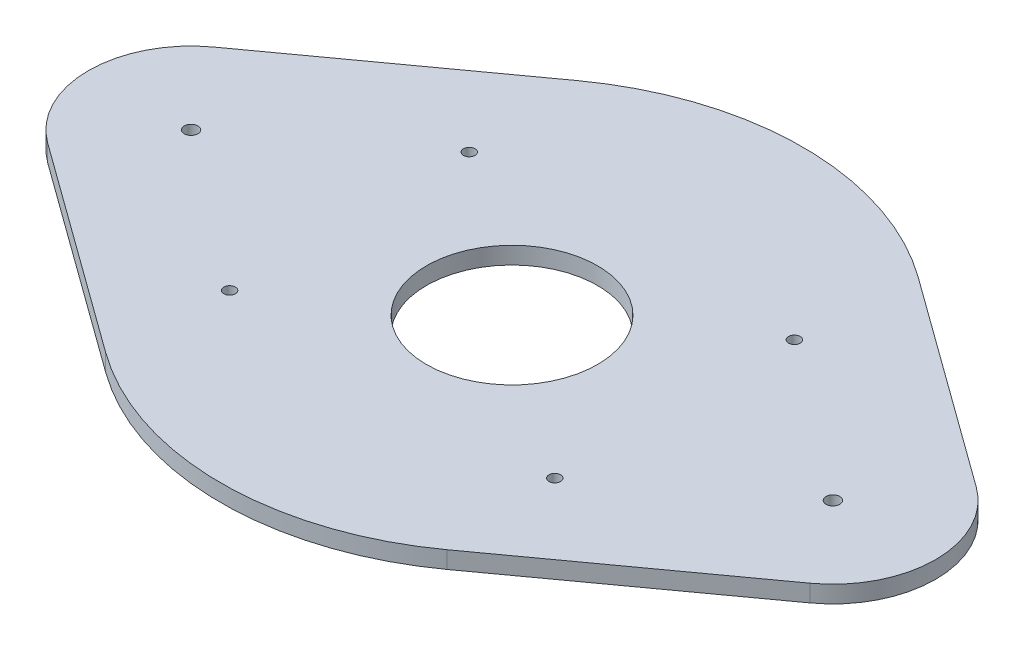
ISO-10303-21;
HEADER;
FILE_DESCRIPTION(('STEP AP214'),'2;1');
FILE_NAME('part.step','',(''),(''),'','','');
FILE_SCHEMA(('AUTOMOTIVE_DESIGN { 1 0 10303 214 1 1 1 1 }'));
ENDSEC;
DATA;
#1=APPLICATION_CONTEXT('core data for automotive mechanical design processes');
#2=APPLICATION_PROTOCOL_DEFINITION('international standard','automotive_design',2000,#1);
#3=PRODUCT_CONTEXT('',#1,'mechanical');
#4=PRODUCT('Part','Part','',(#3));
#5=PRODUCT_RELATED_PRODUCT_CATEGORY('part','',(#4));
#6=PRODUCT_DEFINITION_FORMATION('','',#4);
#7=PRODUCT_DEFINITION_CONTEXT('part definition',#1,'design');
#8=PRODUCT_DEFINITION('design','',#6,#7);
#9=PRODUCT_DEFINITION_SHAPE('','',#8);
#10=(LENGTH_UNIT() NAMED_UNIT(*) SI_UNIT(.MILLI.,.METRE.));
#11=(NAMED_UNIT(*) PLANE_ANGLE_UNIT() SI_UNIT($,.RADIAN.));
#12=(NAMED_UNIT(*) SI_UNIT($,.STERADIAN.) SOLID_ANGLE_UNIT());
#13=UNCERTAINTY_MEASURE_WITH_UNIT(LENGTH_MEASURE(1.E-05),#10,'distance_accuracy_value','');
#14=(GEOMETRIC_REPRESENTATION_CONTEXT(3) GLOBAL_UNCERTAINTY_ASSIGNED_CONTEXT((#13)) GLOBAL_UNIT_ASSIGNED_CONTEXT((#10,
#11,#12)) REPRESENTATION_CONTEXT('',''));
#15=CARTESIAN_POINT('',(0.,0.,0.));
#16=DIRECTION('',(0.,0.,1.));
#17=DIRECTION('',(1.,0.,0.));
#18=AXIS2_PLACEMENT_3D('',#15,#16,#17);
#19=CARTESIAN_POINT('',(0.,10.,0.));
#20=DIRECTION('',(0.,-1.,0.));
#21=DIRECTION('',(0.,0.,-1.));
#22=AXIS2_PLACEMENT_3D('',#19,#20,#21);
#23=CYLINDRICAL_SURFACE('',#22,170.);
#24=CARTESIAN_POINT('',(0.,0.,0.));
#25=DIRECTION('',(0.,1.,0.));
#26=DIRECTION('',(0.,0.,1.));
#27=AXIS2_PLACEMENT_3D('',#24,#25,#26);
#28=CIRCLE('',#27,170.);
#29=CARTESIAN_POINT('',(99.7333333333334,0.,137.670847394146));
#30=VERTEX_POINT('',#29);
#31=CARTESIAN_POINT('',(-99.7333333333333,0.,137.670847394146));
#32=VERTEX_POINT('',#31);
#33=EDGE_CURVE('E174',#30,#32,#28,.F.);
#34=ORIENTED_EDGE('',*,*,#33,.F.);
#35=DIRECTION('',(0.,-1.,0.));
#36=VECTOR('',#35,1.);
#37=CARTESIAN_POINT('',(99.7333333333334,10.,137.670847394146));
#38=LINE('',#37,#36);
#39=CARTESIAN_POINT('',(99.7333333333334,10.,137.670847394146));
#40=VERTEX_POINT('',#39);
#41=EDGE_CURVE('E11',#40,#30,#38,.T.);
#42=ORIENTED_EDGE('',*,*,#41,.F.);
#43=CARTESIAN_POINT('',(0.,10.,0.));
#44=DIRECTION('',(0.,1.,0.));
#45=DIRECTION('',(0.,0.,1.));
#46=AXIS2_PLACEMENT_3D('',#43,#44,#45);
#47=CIRCLE('',#46,170.);
#48=CARTESIAN_POINT('',(-99.7333333333333,10.,137.670847394146));
#49=VERTEX_POINT('',#48);
#50=EDGE_CURVE('E232',#40,#49,#47,.F.);
#51=ORIENTED_EDGE('',*,*,#50,.T.);
#52=DIRECTION('',(0.,-1.,0.));
#53=VECTOR('',#52,1.);
#54=CARTESIAN_POINT('',(-99.7333333333333,10.,137.670847394146));
#55=LINE('',#54,#53);
#56=EDGE_CURVE('E99',#49,#32,#55,.T.);
#57=ORIENTED_EDGE('',*,*,#56,.T.);
#58=EDGE_LOOP('',(#34,#42,#51,#57));
#59=FACE_BOUND('',#58,.T.);
#60=ADVANCED_FACE('F47',(#59),#23,.T.);
#61=CARTESIAN_POINT('',(99.7333333333334,10.,137.670847394146));
#62=DIRECTION('',(0.586666666666667,0.,0.809828514083211));
#63=DIRECTION('',(0.809828514083211,0.,-0.586666666666667));
#64=AXIS2_PLACEMENT_3D('',#61,#62,#63);
#65=PLANE('',#64);
#66=DIRECTION('',(-0.809828514083211,0.,0.586666666666667));
#67=VECTOR('',#66,1.);
#68=CARTESIAN_POINT('',(99.7333333333334,0.,137.670847394146));
#69=LINE('',#68,#67);
#70=CARTESIAN_POINT('',(222.7,0.,48.5897108449927));
#71=VERTEX_POINT('',#70);
#72=EDGE_CURVE('E178',#71,#30,#69,.T.);
#73=ORIENTED_EDGE('',*,*,#72,.F.);
#74=DIRECTION('',(0.,-1.,0.));
#75=VECTOR('',#74,1.);
#76=CARTESIAN_POINT('',(222.7,10.,48.5897108449927));
#77=LINE('',#76,#75);
#78=CARTESIAN_POINT('',(222.7,10.,48.5897108449927));
#79=VERTEX_POINT('',#78);
#80=EDGE_CURVE('E57',#79,#71,#77,.T.);
#81=ORIENTED_EDGE('',*,*,#80,.F.);
#82=DIRECTION('',(-0.809828514083211,0.,0.586666666666667));
#83=VECTOR('',#82,1.);
#84=CARTESIAN_POINT('',(99.7333333333334,10.,137.670847394146));
#85=LINE('',#84,#83);
#86=EDGE_CURVE('E230',#79,#40,#85,.T.);
#87=ORIENTED_EDGE('',*,*,#86,.T.);
#88=ORIENTED_EDGE('',*,*,#41,.T.);
#89=EDGE_LOOP('',(#73,#81,#87,#88));
#90=FACE_BOUND('',#89,.T.);
#91=ADVANCED_FACE('F229',(#90),#65,.T.);
#92=CARTESIAN_POINT('',(187.5,10.,0.));
#93=DIRECTION('',(0.,-1.,0.));
#94=DIRECTION('',(0.,0.,-1.));
#95=AXIS2_PLACEMENT_3D('',#92,#93,#94);
#96=CYLINDRICAL_SURFACE('',#95,60.);
#97=CARTESIAN_POINT('',(187.5,0.,0.));
#98=DIRECTION('',(0.,1.,0.));
#99=DIRECTION('',(0.,0.,1.));
#100=AXIS2_PLACEMENT_3D('',#97,#98,#99);
#101=CIRCLE('',#100,60.);
#102=CARTESIAN_POINT('',(222.7,0.,-48.5897108449928));
#103=VERTEX_POINT('',#102);
#104=EDGE_CURVE('E182',#71,#103,#101,.T.);
#105=ORIENTED_EDGE('',*,*,#104,.T.);
#106=DIRECTION('',(0.,-1.,0.));
#107=VECTOR('',#106,1.);
#108=CARTESIAN_POINT('',(222.7,10.,-48.5897108449928));
#109=LINE('',#108,#107);
#110=CARTESIAN_POINT('',(222.7,10.,-48.5897108449928));
#111=VERTEX_POINT('',#110);
#112=EDGE_CURVE('E212',#111,#103,#109,.T.);
#113=ORIENTED_EDGE('',*,*,#112,.F.);
#114=CARTESIAN_POINT('',(187.5,10.,0.));
#115=DIRECTION('',(0.,1.,0.));
#116=DIRECTION('',(0.,0.,1.));
#117=AXIS2_PLACEMENT_3D('',#114,#115,#116);
#118=CIRCLE('',#117,60.);
#119=EDGE_CURVE('E220',#79,#111,#118,.T.);
#120=ORIENTED_EDGE('',*,*,#119,.F.);
#121=ORIENTED_EDGE('',*,*,#80,.T.);
#122=EDGE_LOOP('',(#105,#113,#120,#121));
#123=FACE_BOUND('',#122,.T.);
#124=ADVANCED_FACE('F218',(#123),#96,.T.);
#125=CARTESIAN_POINT('',(99.7333333333333,10.,-137.670847394146));
#126=DIRECTION('',(0.586666666666666,0.,-0.809828514083212));
#127=DIRECTION('',(-0.809828514083212,0.,-0.586666666666666));
#128=AXIS2_PLACEMENT_3D('',#125,#126,#127);
#129=PLANE('',#128);
#130=DIRECTION('',(0.809828514083212,0.,0.586666666666666));
#131=VECTOR('',#130,1.);
#132=CARTESIAN_POINT('',(99.7333333333333,0.,-137.670847394146));
#133=LINE('',#132,#131);
#134=CARTESIAN_POINT('',(99.7333333333333,0.,-137.670847394146));
#135=VERTEX_POINT('',#134);
#136=EDGE_CURVE('E186',#135,#103,#133,.T.);
#137=ORIENTED_EDGE('',*,*,#136,.F.);
#138=DIRECTION('',(0.,-1.,0.));
#139=VECTOR('',#138,1.);
#140=CARTESIAN_POINT('',(99.7333333333333,10.,-137.670847394146));
#141=LINE('',#140,#139);
#142=CARTESIAN_POINT('',(99.7333333333333,10.,-137.670847394146));
#143=VERTEX_POINT('',#142);
#144=EDGE_CURVE('E209',#143,#135,#141,.T.);
#145=ORIENTED_EDGE('',*,*,#144,.F.);
#146=DIRECTION('',(0.809828514083212,0.,0.586666666666666));
#147=VECTOR('',#146,1.);
#148=CARTESIAN_POINT('',(99.7333333333333,10.,-137.670847394146));
#149=LINE('',#148,#147);
#150=EDGE_CURVE('E246',#143,#111,#149,.T.);
#151=ORIENTED_EDGE('',*,*,#150,.T.);
#152=ORIENTED_EDGE('',*,*,#112,.T.);
#153=EDGE_LOOP('',(#137,#145,#151,#152));
#154=FACE_BOUND('',#153,.T.);
#155=ADVANCED_FACE('F251',(#154),#129,.T.);
#156=CARTESIAN_POINT('',(0.,10.,0.));
#157=DIRECTION('',(0.,-1.,0.));
#158=DIRECTION('',(0.,0.,-1.));
#159=AXIS2_PLACEMENT_3D('',#156,#157,#158);
#160=CYLINDRICAL_SURFACE('',#159,170.);
#161=CARTESIAN_POINT('',(0.,0.,0.));
#162=DIRECTION('',(0.,1.,0.));
#163=DIRECTION('',(0.,0.,1.));
#164=AXIS2_PLACEMENT_3D('',#161,#162,#163);
#165=CIRCLE('',#164,170.);
#166=CARTESIAN_POINT('',(-99.7333333333333,0.,-137.670847394146));
#167=VERTEX_POINT('',#166);
#168=EDGE_CURVE('E190',#135,#167,#165,.T.);
#169=ORIENTED_EDGE('',*,*,#168,.T.);
#170=DIRECTION('',(0.,-1.,0.));
#171=VECTOR('',#170,1.);
#172=CARTESIAN_POINT('',(-99.7333333333333,10.,-137.670847394146));
#173=LINE('',#172,#171);
#174=CARTESIAN_POINT('',(-99.7333333333333,10.,-137.670847394146));
#175=VERTEX_POINT('',#174);
#176=EDGE_CURVE('E137',#175,#167,#173,.T.);
#177=ORIENTED_EDGE('',*,*,#176,.F.);
#178=CARTESIAN_POINT('',(0.,10.,0.));
#179=DIRECTION('',(0.,1.,0.));
#180=DIRECTION('',(0.,0.,1.));
#181=AXIS2_PLACEMENT_3D('',#178,#179,#180);
#182=CIRCLE('',#181,170.);
#183=EDGE_CURVE('E123',#143,#175,#182,.T.);
#184=ORIENTED_EDGE('',*,*,#183,.F.);
#185=ORIENTED_EDGE('',*,*,#144,.T.);
#186=EDGE_LOOP('',(#169,#177,#184,#185));
#187=FACE_BOUND('',#186,.T.);
#188=ADVANCED_FACE('F253',(#187),#160,.T.);
#189=CARTESIAN_POINT('',(-99.7333333333333,10.,-137.670847394146));
#190=DIRECTION('',(0.586666666666667,0.,0.809828514083212));
#191=DIRECTION('',(0.809828514083211,0.,-0.586666666666667));
#192=AXIS2_PLACEMENT_3D('',#189,#190,#191);
#193=PLANE('',#192);
#194=DIRECTION('',(-0.809828514083211,0.,0.586666666666667));
#195=VECTOR('',#194,1.);
#196=CARTESIAN_POINT('',(-99.7333333333333,0.,-137.670847394146));
#197=LINE('',#196,#195);
#198=CARTESIAN_POINT('',(-222.7,0.,-48.5897108449927));
#199=VERTEX_POINT('',#198);
#200=EDGE_CURVE('E132',#167,#199,#197,.T.);
#201=ORIENTED_EDGE('',*,*,#200,.T.);
#202=DIRECTION('',(0.,-1.,0.));
#203=VECTOR('',#202,1.);
#204=CARTESIAN_POINT('',(-222.7,10.,-48.5897108449927));
#205=LINE('',#204,#203);
#206=CARTESIAN_POINT('',(-222.7,10.,-48.5897108449927));
#207=VERTEX_POINT('',#206);
#208=EDGE_CURVE('E130',#207,#199,#205,.T.);
#209=ORIENTED_EDGE('',*,*,#208,.F.);
#210=DIRECTION('',(-0.809828514083211,0.,0.586666666666667));
#211=VECTOR('',#210,1.);
#212=CARTESIAN_POINT('',(-99.7333333333333,10.,-137.670847394146));
#213=LINE('',#212,#211);
#214=EDGE_CURVE('E116',#175,#207,#213,.T.);
#215=ORIENTED_EDGE('',*,*,#214,.F.);
#216=ORIENTED_EDGE('',*,*,#176,.T.);
#217=EDGE_LOOP('',(#201,#209,#215,#216));
#218=FACE_BOUND('',#217,.T.);
#219=ADVANCED_FACE('F131',(#218),#193,.F.);
#220=CARTESIAN_POINT('',(-187.5,10.,0.));
#221=DIRECTION('',(0.,-1.,0.));
#222=DIRECTION('',(0.,0.,-1.));
#223=AXIS2_PLACEMENT_3D('',#220,#221,#222);
#224=CYLINDRICAL_SURFACE('',#223,60.);
#225=CARTESIAN_POINT('',(-187.5,0.,0.));
#226=DIRECTION('',(0.,1.,0.));
#227=DIRECTION('',(0.,0.,1.));
#228=AXIS2_PLACEMENT_3D('',#225,#226,#227);
#229=CIRCLE('',#228,60.);
#230=CARTESIAN_POINT('',(-222.7,0.,48.5897108449927));
#231=VERTEX_POINT('',#230);
#232=EDGE_CURVE('E196',#231,#199,#229,.F.);
#233=ORIENTED_EDGE('',*,*,#232,.F.);
#234=DIRECTION('',(0.,-1.,0.));
#235=VECTOR('',#234,1.);
#236=CARTESIAN_POINT('',(-222.7,10.,48.5897108449927));
#237=LINE('',#236,#235);
#238=CARTESIAN_POINT('',(-222.7,10.,48.5897108449927));
#239=VERTEX_POINT('',#238);
#240=EDGE_CURVE('E92',#239,#231,#237,.T.);
#241=ORIENTED_EDGE('',*,*,#240,.F.);
#242=CARTESIAN_POINT('',(-187.5,10.,0.));
#243=DIRECTION('',(0.,1.,0.));
#244=DIRECTION('',(0.,0.,1.));
#245=AXIS2_PLACEMENT_3D('',#242,#243,#244);
#246=CIRCLE('',#245,60.);
#247=EDGE_CURVE('E120',#239,#207,#246,.F.);
#248=ORIENTED_EDGE('',*,*,#247,.T.);
#249=ORIENTED_EDGE('',*,*,#208,.T.);
#250=EDGE_LOOP('',(#233,#241,#248,#249));
#251=FACE_BOUND('',#250,.T.);
#252=ADVANCED_FACE('F139',(#251),#224,.T.);
#253=CARTESIAN_POINT('',(0.,10.,0.));
#254=DIRECTION('',(0.,-1.,0.));
#255=DIRECTION('',(0.,0.,-1.));
#256=AXIS2_PLACEMENT_3D('',#253,#254,#255);
#257=CYLINDRICAL_SURFACE('',#256,50.);
#258=CARTESIAN_POINT('',(0.,10.,0.));
#259=DIRECTION('',(0.,1.,0.));
#260=DIRECTION('',(0.,0.,1.));
#261=AXIS2_PLACEMENT_3D('',#258,#259,#260);
#262=CIRCLE('',#261,50.);
#263=CARTESIAN_POINT('',(0.,10.,50.));
#264=VERTEX_POINT('',#263);
#265=EDGE_CURVE('E234',#264,#264,#262,.T.);
#266=ORIENTED_EDGE('',*,*,#265,.T.);
#267=EDGE_LOOP('',(#266));
#268=FACE_BOUND('',#267,.T.);
#269=CARTESIAN_POINT('',(0.,0.,0.));
#270=DIRECTION('',(0.,1.,0.));
#271=DIRECTION('',(0.,0.,1.));
#272=AXIS2_PLACEMENT_3D('',#269,#270,#271);
#273=CIRCLE('',#272,50.);
#274=CARTESIAN_POINT('',(0.,0.,50.));
#275=VERTEX_POINT('',#274);
#276=EDGE_CURVE('E170',#275,#275,#273,.T.);
#277=ORIENTED_EDGE('',*,*,#276,.F.);
#278=EDGE_LOOP('',(#277));
#279=FACE_BOUND('',#278,.T.);
#280=ADVANCED_FACE('F270',(#268,#279),#257,.F.);
#281=CARTESIAN_POINT('',(-95.,10.,-70.));
#282=DIRECTION('',(0.,-1.,0.));
#283=DIRECTION('',(0.,0.,-1.));
#284=AXIS2_PLACEMENT_3D('',#281,#282,#283);
#285=CYLINDRICAL_SURFACE('',#284,3.4);
#286=CARTESIAN_POINT('',(-95.,10.,-70.));
#287=DIRECTION('',(0.,1.,0.));
#288=DIRECTION('',(0.,0.,1.));
#289=AXIS2_PLACEMENT_3D('',#286,#287,#288);
#290=CIRCLE('',#289,3.4);
#291=CARTESIAN_POINT('',(-95.,10.,-66.6));
#292=VERTEX_POINT('',#291);
#293=EDGE_CURVE('E240',#292,#292,#290,.T.);
#294=ORIENTED_EDGE('',*,*,#293,.T.);
#295=EDGE_LOOP('',(#294));
#296=FACE_BOUND('',#295,.T.);
#297=CARTESIAN_POINT('',(-95.,0.,-70.));
#298=DIRECTION('',(0.,1.,0.));
#299=DIRECTION('',(0.,0.,1.));
#300=AXIS2_PLACEMENT_3D('',#297,#298,#299);
#301=CIRCLE('',#300,3.4);
#302=CARTESIAN_POINT('',(-95.,0.,-66.6));
#303=VERTEX_POINT('',#302);
#304=EDGE_CURVE('E166',#303,#303,#301,.T.);
#305=ORIENTED_EDGE('',*,*,#304,.F.);
#306=EDGE_LOOP('',(#305));
#307=FACE_BOUND('',#306,.T.);
#308=ADVANCED_FACE('F273',(#296,#307),#285,.F.);
#309=CARTESIAN_POINT('',(95.,10.,-70.));
#310=DIRECTION('',(0.,-1.,0.));
#311=DIRECTION('',(0.,0.,-1.));
#312=AXIS2_PLACEMENT_3D('',#309,#310,#311);
#313=CYLINDRICAL_SURFACE('',#312,3.4);
#314=CARTESIAN_POINT('',(95.,10.,-70.));
#315=DIRECTION('',(0.,1.,0.));
#316=DIRECTION('',(0.,0.,1.));
#317=AXIS2_PLACEMENT_3D('',#314,#315,#316);
#318=CIRCLE('',#317,3.4);
#319=CARTESIAN_POINT('',(95.,10.,-66.6));
#320=VERTEX_POINT('',#319);
#321=EDGE_CURVE('E441',#320,#320,#318,.T.);
#322=ORIENTED_EDGE('',*,*,#321,.T.);
#323=EDGE_LOOP('',(#322));
#324=FACE_BOUND('',#323,.T.);
#325=CARTESIAN_POINT('',(95.,0.,-70.));
#326=DIRECTION('',(0.,1.,0.));
#327=DIRECTION('',(0.,0.,1.));
#328=AXIS2_PLACEMENT_3D('',#325,#326,#327);
#329=CIRCLE('',#328,3.4);
#330=CARTESIAN_POINT('',(95.,0.,-66.6));
#331=VERTEX_POINT('',#330);
#332=EDGE_CURVE('E162',#331,#331,#329,.T.);
#333=ORIENTED_EDGE('',*,*,#332,.F.);
#334=EDGE_LOOP('',(#333));
#335=FACE_BOUND('',#334,.T.);
#336=ADVANCED_FACE('F277',(#324,#335),#313,.F.);
#337=CARTESIAN_POINT('',(95.,10.,70.));
#338=DIRECTION('',(0.,-1.,0.));
#339=DIRECTION('',(0.,0.,-1.));
#340=AXIS2_PLACEMENT_3D('',#337,#338,#339);
#341=CYLINDRICAL_SURFACE('',#340,3.4);
#342=CARTESIAN_POINT('',(95.,10.,70.));
#343=DIRECTION('',(0.,1.,0.));
#344=DIRECTION('',(0.,0.,1.));
#345=AXIS2_PLACEMENT_3D('',#342,#343,#344);
#346=CIRCLE('',#345,3.4);
#347=CARTESIAN_POINT('',(95.,10.,73.4));
#348=VERTEX_POINT('',#347);
#349=EDGE_CURVE('E437',#348,#348,#346,.T.);
#350=ORIENTED_EDGE('',*,*,#349,.T.);
#351=EDGE_LOOP('',(#350));
#352=FACE_BOUND('',#351,.T.);
#353=CARTESIAN_POINT('',(95.,0.,70.));
#354=DIRECTION('',(0.,1.,0.));
#355=DIRECTION('',(0.,0.,1.));
#356=AXIS2_PLACEMENT_3D('',#353,#354,#355);
#357=CIRCLE('',#356,3.4);
#358=CARTESIAN_POINT('',(95.,0.,73.4));
#359=VERTEX_POINT('',#358);
#360=EDGE_CURVE('E158',#359,#359,#357,.T.);
#361=ORIENTED_EDGE('',*,*,#360,.F.);
#362=EDGE_LOOP('',(#361));
#363=FACE_BOUND('',#362,.T.);
#364=ADVANCED_FACE('F281',(#352,#363),#341,.F.);
#365=CARTESIAN_POINT('',(-95.,10.,70.));
#366=DIRECTION('',(0.,-1.,0.));
#367=DIRECTION('',(0.,0.,-1.));
#368=AXIS2_PLACEMENT_3D('',#365,#366,#367);
#369=CYLINDRICAL_SURFACE('',#368,3.40000000000001);
#370=CARTESIAN_POINT('',(-95.,10.,70.));
#371=DIRECTION('',(0.,1.,0.));
#372=DIRECTION('',(0.,0.,1.));
#373=AXIS2_PLACEMENT_3D('',#370,#371,#372);
#374=CIRCLE('',#373,3.40000000000001);
#375=CARTESIAN_POINT('',(-95.,10.,73.4));
#376=VERTEX_POINT('',#375);
#377=EDGE_CURVE('E433',#376,#376,#374,.T.);
#378=ORIENTED_EDGE('',*,*,#377,.T.);
#379=EDGE_LOOP('',(#378));
#380=FACE_BOUND('',#379,.T.);
#381=CARTESIAN_POINT('',(-95.,0.,70.));
#382=DIRECTION('',(0.,1.,0.));
#383=DIRECTION('',(0.,0.,1.));
#384=AXIS2_PLACEMENT_3D('',#381,#382,#383);
#385=CIRCLE('',#384,3.40000000000001);
#386=CARTESIAN_POINT('',(-95.,0.,73.4));
#387=VERTEX_POINT('',#386);
#388=EDGE_CURVE('E154',#387,#387,#385,.T.);
#389=ORIENTED_EDGE('',*,*,#388,.F.);
#390=EDGE_LOOP('',(#389));
#391=FACE_BOUND('',#390,.T.);
#392=ADVANCED_FACE('F285',(#380,#391),#369,.F.);
#393=CARTESIAN_POINT('',(187.5,10.,0.));
#394=DIRECTION('',(0.,-1.,0.));
#395=DIRECTION('',(0.,0.,-1.));
#396=AXIS2_PLACEMENT_3D('',#393,#394,#395);
#397=CYLINDRICAL_SURFACE('',#396,3.99999999999999);
#398=CARTESIAN_POINT('',(187.5,10.,0.));
#399=DIRECTION('',(0.,1.,0.));
#400=DIRECTION('',(0.,0.,1.));
#401=AXIS2_PLACEMENT_3D('',#398,#399,#400);
#402=CIRCLE('',#401,3.99999999999999);
#403=CARTESIAN_POINT('',(187.5,10.,3.99999999999992));
#404=VERTEX_POINT('',#403);
#405=EDGE_CURVE('E299',#404,#404,#402,.T.);
#406=ORIENTED_EDGE('',*,*,#405,.T.);
#407=EDGE_LOOP('',(#406));
#408=FACE_BOUND('',#407,.T.);
#409=CARTESIAN_POINT('',(187.5,0.,0.));
#410=DIRECTION('',(0.,1.,0.));
#411=DIRECTION('',(0.,0.,1.));
#412=AXIS2_PLACEMENT_3D('',#409,#410,#411);
#413=CIRCLE('',#412,3.99999999999999);
#414=CARTESIAN_POINT('',(187.5,0.,3.99999999999992));
#415=VERTEX_POINT('',#414);
#416=EDGE_CURVE('E150',#415,#415,#413,.T.);
#417=ORIENTED_EDGE('',*,*,#416,.F.);
#418=EDGE_LOOP('',(#417));
#419=FACE_BOUND('',#418,.T.);
#420=ADVANCED_FACE('F288',(#408,#419),#397,.F.);
#421=CARTESIAN_POINT('',(-187.5,10.,0.));
#422=DIRECTION('',(0.,-1.,0.));
#423=DIRECTION('',(0.,0.,-1.));
#424=AXIS2_PLACEMENT_3D('',#421,#422,#423);
#425=CYLINDRICAL_SURFACE('',#424,3.99999999999999);
#426=CARTESIAN_POINT('',(-187.5,10.,0.));
#427=DIRECTION('',(0.,1.,0.));
#428=DIRECTION('',(0.,0.,1.));
#429=AXIS2_PLACEMENT_3D('',#426,#427,#428);
#430=CIRCLE('',#429,3.99999999999999);
#431=CARTESIAN_POINT('',(-187.5,10.,3.99999999999999));
#432=VERTEX_POINT('',#431);
#433=EDGE_CURVE('E202',#432,#432,#430,.T.);
#434=ORIENTED_EDGE('',*,*,#433,.T.);
#435=EDGE_LOOP('',(#434));
#436=FACE_BOUND('',#435,.T.);
#437=CARTESIAN_POINT('',(-187.5,0.,0.));
#438=DIRECTION('',(0.,1.,0.));
#439=DIRECTION('',(0.,0.,1.));
#440=AXIS2_PLACEMENT_3D('',#437,#438,#439);
#441=CIRCLE('',#440,3.99999999999999);
#442=CARTESIAN_POINT('',(-187.5,0.,3.99999999999999));
#443=VERTEX_POINT('',#442);
#444=EDGE_CURVE('E146',#443,#443,#441,.T.);
#445=ORIENTED_EDGE('',*,*,#444,.F.);
#446=EDGE_LOOP('',(#445));
#447=FACE_BOUND('',#446,.T.);
#448=ADVANCED_FACE('F49',(#436,#447),#425,.F.);
#449=CARTESIAN_POINT('',(-99.7333333333333,10.,137.670847394146));
#450=DIRECTION('',(0.586666666666666,0.,-0.809828514083212));
#451=DIRECTION('',(-0.809828514083212,0.,-0.586666666666666));
#452=AXIS2_PLACEMENT_3D('',#449,#450,#451);
#453=PLANE('',#452);
#454=DIRECTION('',(0.809828514083212,0.,0.586666666666666));
#455=VECTOR('',#454,1.);
#456=CARTESIAN_POINT('',(-99.7333333333333,0.,137.670847394146));
#457=LINE('',#456,#455);
#458=EDGE_CURVE('E199',#231,#32,#457,.T.);
#459=ORIENTED_EDGE('',*,*,#458,.T.);
#460=ORIENTED_EDGE('',*,*,#56,.F.);
#461=DIRECTION('',(0.809828514083212,0.,0.586666666666666));
#462=VECTOR('',#461,1.);
#463=CARTESIAN_POINT('',(-99.7333333333333,10.,137.670847394146));
#464=LINE('',#463,#462);
#465=EDGE_CURVE('E65',#239,#49,#464,.T.);
#466=ORIENTED_EDGE('',*,*,#465,.F.);
#467=ORIENTED_EDGE('',*,*,#240,.T.);
#468=EDGE_LOOP('',(#459,#460,#466,#467));
#469=FACE_BOUND('',#468,.T.);
#470=ADVANCED_FACE('F231',(#469),#453,.F.);
#471=CARTESIAN_POINT('',(0.,10.,0.));
#472=DIRECTION('',(0.,1.,0.));
#473=DIRECTION('',(0.,0.,1.));
#474=AXIS2_PLACEMENT_3D('',#471,#472,#473);
#475=PLANE('',#474);
#476=ORIENTED_EDGE('',*,*,#433,.F.);
#477=EDGE_LOOP('',(#476));
#478=FACE_BOUND('',#477,.T.);
#479=ORIENTED_EDGE('',*,*,#405,.F.);
#480=EDGE_LOOP('',(#479));
#481=FACE_BOUND('',#480,.T.);
#482=ORIENTED_EDGE('',*,*,#377,.F.);
#483=EDGE_LOOP('',(#482));
#484=FACE_BOUND('',#483,.T.);
#485=ORIENTED_EDGE('',*,*,#349,.F.);
#486=EDGE_LOOP('',(#485));
#487=FACE_BOUND('',#486,.T.);
#488=ORIENTED_EDGE('',*,*,#321,.F.);
#489=EDGE_LOOP('',(#488));
#490=FACE_BOUND('',#489,.T.);
#491=ORIENTED_EDGE('',*,*,#293,.F.);
#492=EDGE_LOOP('',(#491));
#493=FACE_BOUND('',#492,.T.);
#494=ORIENTED_EDGE('',*,*,#265,.F.);
#495=EDGE_LOOP('',(#494));
#496=FACE_BOUND('',#495,.T.);
#497=ORIENTED_EDGE('',*,*,#50,.F.);
#498=ORIENTED_EDGE('',*,*,#86,.F.);
#499=ORIENTED_EDGE('',*,*,#119,.T.);
#500=ORIENTED_EDGE('',*,*,#150,.F.);
#501=ORIENTED_EDGE('',*,*,#183,.T.);
#502=ORIENTED_EDGE('',*,*,#214,.T.);
#503=ORIENTED_EDGE('',*,*,#247,.F.);
#504=ORIENTED_EDGE('',*,*,#465,.T.);
#505=EDGE_LOOP('',(#497,#498,#499,#500,#501,#502,#503,#504));
#506=FACE_BOUND('',#505,.T.);
#507=ADVANCED_FACE('F118',(#478,#481,#484,#487,#490,#493,#496,#506),#475,.T.);
#508=CARTESIAN_POINT('',(0.,0.,0.));
#509=DIRECTION('',(0.,1.,0.));
#510=DIRECTION('',(0.,0.,1.));
#511=AXIS2_PLACEMENT_3D('',#508,#509,#510);
#512=PLANE('',#511);
#513=ORIENTED_EDGE('',*,*,#444,.T.);
#514=EDGE_LOOP('',(#513));
#515=FACE_BOUND('',#514,.T.);
#516=ORIENTED_EDGE('',*,*,#416,.T.);
#517=EDGE_LOOP('',(#516));
#518=FACE_BOUND('',#517,.T.);
#519=ORIENTED_EDGE('',*,*,#388,.T.);
#520=EDGE_LOOP('',(#519));
#521=FACE_BOUND('',#520,.T.);
#522=ORIENTED_EDGE('',*,*,#360,.T.);
#523=EDGE_LOOP('',(#522));
#524=FACE_BOUND('',#523,.T.);
#525=ORIENTED_EDGE('',*,*,#332,.T.);
#526=EDGE_LOOP('',(#525));
#527=FACE_BOUND('',#526,.T.);
#528=ORIENTED_EDGE('',*,*,#304,.T.);
#529=EDGE_LOOP('',(#528));
#530=FACE_BOUND('',#529,.T.);
#531=ORIENTED_EDGE('',*,*,#276,.T.);
#532=EDGE_LOOP('',(#531));
#533=FACE_BOUND('',#532,.T.);
#534=ORIENTED_EDGE('',*,*,#33,.T.);
#535=ORIENTED_EDGE('',*,*,#458,.F.);
#536=ORIENTED_EDGE('',*,*,#232,.T.);
#537=ORIENTED_EDGE('',*,*,#200,.F.);
#538=ORIENTED_EDGE('',*,*,#168,.F.);
#539=ORIENTED_EDGE('',*,*,#136,.T.);
#540=ORIENTED_EDGE('',*,*,#104,.F.);
#541=ORIENTED_EDGE('',*,*,#72,.T.);
#542=EDGE_LOOP('',(#534,#535,#536,#537,#538,#539,#540,#541));
#543=FACE_BOUND('',#542,.T.);
#544=ADVANCED_FACE('F226',(#515,#518,#521,#524,#527,#530,#533,#543),#512,.F.);
#545=CLOSED_SHELL('',(#60,#91,#124,#155,#188,#219,#252,#280,#308,#336,#364,#392,#420,#448,#470,
#507,#544));
#546=MANIFOLD_SOLID_BREP('B2',#545);
#547=ADVANCED_BREP_SHAPE_REPRESENTATION('',(#18,#546),#14);
#548=SHAPE_DEFINITION_REPRESENTATION(#9,#547);
ENDSEC;
END-ISO-10303-21;
